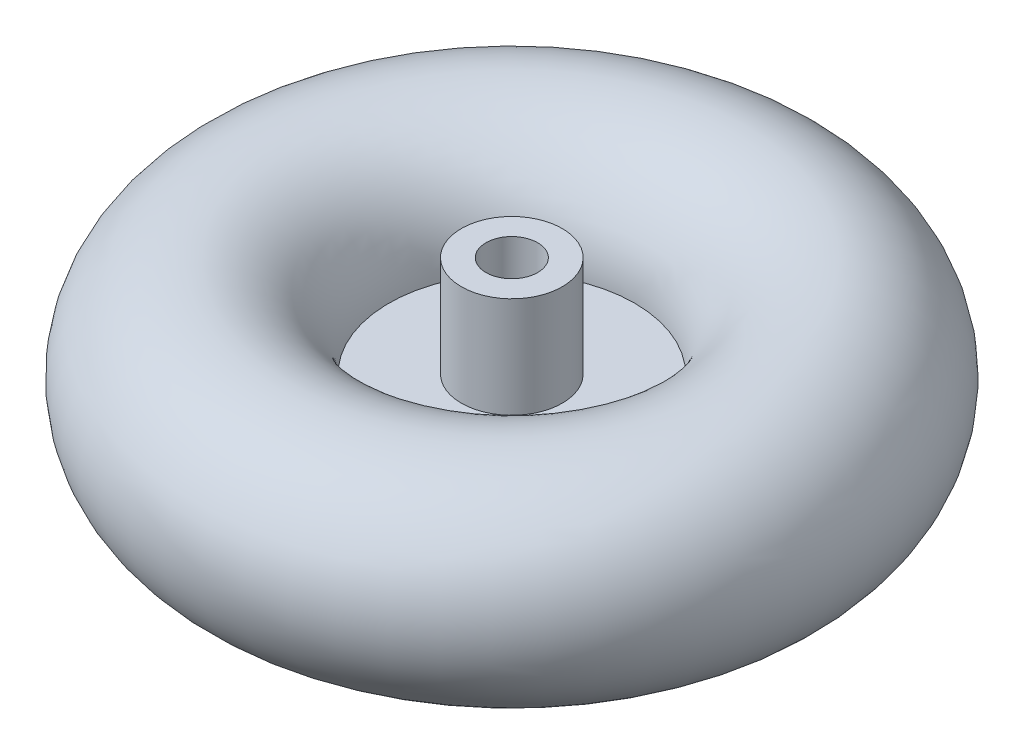
ISO-10303-21;
HEADER;
FILE_DESCRIPTION(('STEP AP214'),'2;1');
FILE_NAME('part.step','',(''),(''),'','','');
FILE_SCHEMA(('AUTOMOTIVE_DESIGN { 1 0 10303 214 1 1 1 1 }'));
ENDSEC;
DATA;
#1=APPLICATION_CONTEXT('core data for automotive mechanical design processes');
#2=APPLICATION_PROTOCOL_DEFINITION('international standard','automotive_design',2000,#1);
#3=PRODUCT_CONTEXT('',#1,'mechanical');
#4=PRODUCT('Part','Part','',(#3));
#5=PRODUCT_RELATED_PRODUCT_CATEGORY('part','',(#4));
#6=PRODUCT_DEFINITION_FORMATION('','',#4);
#7=PRODUCT_DEFINITION_CONTEXT('part definition',#1,'design');
#8=PRODUCT_DEFINITION('design','',#6,#7);
#9=PRODUCT_DEFINITION_SHAPE('','',#8);
#10=(LENGTH_UNIT() NAMED_UNIT(*) SI_UNIT(.MILLI.,.METRE.));
#11=(NAMED_UNIT(*) PLANE_ANGLE_UNIT() SI_UNIT($,.RADIAN.));
#12=(NAMED_UNIT(*) SI_UNIT($,.STERADIAN.) SOLID_ANGLE_UNIT());
#13=UNCERTAINTY_MEASURE_WITH_UNIT(LENGTH_MEASURE(1.E-05),#10,'distance_accuracy_value','');
#14=(GEOMETRIC_REPRESENTATION_CONTEXT(3) GLOBAL_UNCERTAINTY_ASSIGNED_CONTEXT((#13)) GLOBAL_UNIT_ASSIGNED_CONTEXT((#10,
#11,#12)) REPRESENTATION_CONTEXT('',''));
#15=CARTESIAN_POINT('',(0.,0.,0.));
#16=DIRECTION('',(0.,0.,1.));
#17=DIRECTION('',(1.,0.,0.));
#18=AXIS2_PLACEMENT_3D('',#15,#16,#17);
#19=CARTESIAN_POINT('',(0.,-3.33066907387547E-13,0.));
#20=DIRECTION('',(0.,-1.,0.));
#21=DIRECTION('',(1.,0.,0.));
#22=AXIS2_PLACEMENT_3D('',#19,#20,#21);
#23=TOROIDAL_SURFACE('',#22,87.5,40.);
#24=CARTESIAN_POINT('',(0.,1.,0.));
#25=DIRECTION('',(0.,-1.,0.));
#26=DIRECTION('',(0.,0.,-1.));
#27=AXIS2_PLACEMENT_3D('',#24,#25,#26);
#28=CIRCLE('',#27,47.5125019537356);
#29=CARTESIAN_POINT('',(0.,1.,-47.5125019537356));
#30=VERTEX_POINT('',#29);
#31=EDGE_CURVE('E10',#30,#30,#28,.F.);
#32=ORIENTED_EDGE('',*,*,#31,.F.);
#33=EDGE_LOOP('',(#32));
#34=FACE_BOUND('',#33,.T.);
#35=CARTESIAN_POINT('',(0.,-1.,0.));
#36=DIRECTION('',(0.,-1.,0.));
#37=DIRECTION('',(0.,0.,-1.));
#38=AXIS2_PLACEMENT_3D('',#35,#36,#37);
#39=CIRCLE('',#38,47.5125019537356);
#40=CARTESIAN_POINT('',(0.,-1.,-47.5125019537356));
#41=VERTEX_POINT('',#40);
#42=EDGE_CURVE('E40',#41,#41,#39,.F.);
#43=ORIENTED_EDGE('',*,*,#42,.T.);
#44=EDGE_LOOP('',(#43));
#45=FACE_BOUND('',#44,.T.);
#46=ADVANCED_FACE('F33',(#34,#45),#23,.T.);
#47=CARTESIAN_POINT('',(0.,-1.,0.));
#48=DIRECTION('',(0.,1.,0.));
#49=DIRECTION('',(0.,0.,1.));
#50=AXIS2_PLACEMENT_3D('',#47,#48,#49);
#51=PLANE('',#50);
#52=CARTESIAN_POINT('',(0.,-1.,0.));
#53=DIRECTION('',(0.,1.,0.));
#54=DIRECTION('',(0.,0.,1.));
#55=AXIS2_PLACEMENT_3D('',#52,#53,#54);
#56=CIRCLE('',#55,10.);
#57=CARTESIAN_POINT('',(0.,-1.,10.));
#58=VERTEX_POINT('',#57);
#59=EDGE_CURVE('E36',#58,#58,#56,.T.);
#60=ORIENTED_EDGE('',*,*,#59,.T.);
#61=EDGE_LOOP('',(#60));
#62=FACE_BOUND('',#61,.T.);
#63=ORIENTED_EDGE('',*,*,#42,.F.);
#64=EDGE_LOOP('',(#63));
#65=FACE_BOUND('',#64,.T.);
#66=ADVANCED_FACE('F59',(#62,#65),#51,.F.);
#67=CARTESIAN_POINT('',(0.,1.,0.));
#68=DIRECTION('',(0.,1.,0.));
#69=DIRECTION('',(0.,0.,1.));
#70=AXIS2_PLACEMENT_3D('',#67,#68,#69);
#71=PLANE('',#70);
#72=CARTESIAN_POINT('',(0.,1.,0.));
#73=DIRECTION('',(0.,1.,0.));
#74=DIRECTION('',(0.,0.,1.));
#75=AXIS2_PLACEMENT_3D('',#72,#73,#74);
#76=CIRCLE('',#75,19.5);
#77=CARTESIAN_POINT('',(0.,1.,19.5));
#78=VERTEX_POINT('',#77);
#79=EDGE_CURVE('E47',#78,#78,#76,.T.);
#80=ORIENTED_EDGE('',*,*,#79,.F.);
#81=EDGE_LOOP('',(#80));
#82=FACE_BOUND('',#81,.T.);
#83=ORIENTED_EDGE('',*,*,#31,.T.);
#84=EDGE_LOOP('',(#83));
#85=FACE_BOUND('',#84,.T.);
#86=ADVANCED_FACE('F79',(#82,#85),#71,.T.);
#87=CARTESIAN_POINT('',(0.,40.,0.));
#88=DIRECTION('',(0.,1.,0.));
#89=DIRECTION('',(0.,0.,1.));
#90=AXIS2_PLACEMENT_3D('',#87,#88,#89);
#91=PLANE('',#90);
#92=CARTESIAN_POINT('',(0.,40.,0.));
#93=DIRECTION('',(0.,1.,0.));
#94=DIRECTION('',(0.,0.,1.));
#95=AXIS2_PLACEMENT_3D('',#92,#93,#94);
#96=CIRCLE('',#95,19.5);
#97=CARTESIAN_POINT('',(0.,40.,19.5));
#98=VERTEX_POINT('',#97);
#99=EDGE_CURVE('E44',#98,#98,#96,.T.);
#100=ORIENTED_EDGE('',*,*,#99,.T.);
#101=EDGE_LOOP('',(#100));
#102=FACE_BOUND('',#101,.T.);
#103=CARTESIAN_POINT('',(0.,40.,0.));
#104=DIRECTION('',(0.,1.,0.));
#105=DIRECTION('',(0.,0.,1.));
#106=AXIS2_PLACEMENT_3D('',#103,#104,#105);
#107=CIRCLE('',#106,10.);
#108=CARTESIAN_POINT('',(0.,40.,10.));
#109=VERTEX_POINT('',#108);
#110=EDGE_CURVE('E50',#109,#109,#107,.T.);
#111=ORIENTED_EDGE('',*,*,#110,.F.);
#112=EDGE_LOOP('',(#111));
#113=FACE_BOUND('',#112,.T.);
#114=ADVANCED_FACE('F69',(#102,#113),#91,.T.);
#115=CARTESIAN_POINT('',(0.,40.,0.));
#116=DIRECTION('',(0.,-1.,0.));
#117=DIRECTION('',(0.,0.,-1.));
#118=AXIS2_PLACEMENT_3D('',#115,#116,#117);
#119=CYLINDRICAL_SURFACE('',#118,19.5);
#120=ORIENTED_EDGE('',*,*,#99,.F.);
#121=EDGE_LOOP('',(#120));
#122=FACE_BOUND('',#121,.T.);
#123=ORIENTED_EDGE('',*,*,#79,.T.);
#124=EDGE_LOOP('',(#123));
#125=FACE_BOUND('',#124,.T.);
#126=ADVANCED_FACE('F64',(#122,#125),#119,.T.);
#127=CARTESIAN_POINT('',(0.,40.,0.));
#128=DIRECTION('',(0.,-1.,0.));
#129=DIRECTION('',(0.,0.,-1.));
#130=AXIS2_PLACEMENT_3D('',#127,#128,#129);
#131=CYLINDRICAL_SURFACE('',#130,10.);
#132=ORIENTED_EDGE('',*,*,#110,.T.);
#133=EDGE_LOOP('',(#132));
#134=FACE_BOUND('',#133,.T.);
#135=ORIENTED_EDGE('',*,*,#59,.F.);
#136=EDGE_LOOP('',(#135));
#137=FACE_BOUND('',#136,.T.);
#138=ADVANCED_FACE('F62',(#134,#137),#131,.F.);
#139=CLOSED_SHELL('',(#46,#66,#86,#114,#126,#138));
#140=MANIFOLD_SOLID_BREP('B2',#139);
#141=ADVANCED_BREP_SHAPE_REPRESENTATION('',(#18,#140),#14);
#142=SHAPE_DEFINITION_REPRESENTATION(#9,#141);
ENDSEC;
END-ISO-10303-21;
